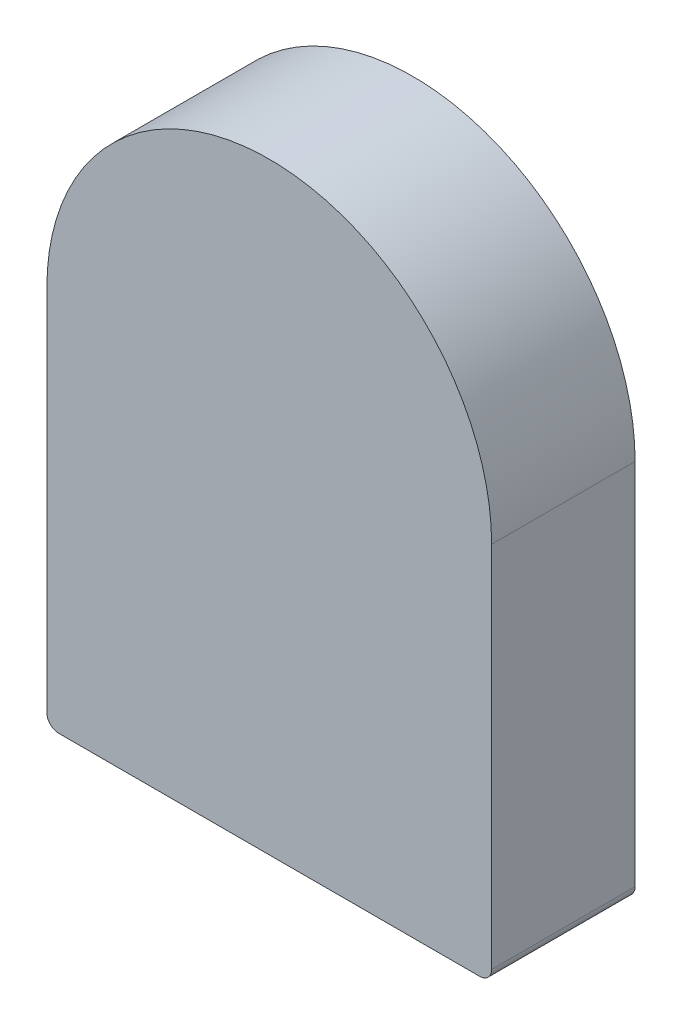
ISO-10303-21;
HEADER;
FILE_DESCRIPTION(('STEP AP214'),'2;1');
FILE_NAME('part.step','',(''),(''),'','','');
FILE_SCHEMA(('AUTOMOTIVE_DESIGN { 1 0 10303 214 1 1 1 1 }'));
ENDSEC;
DATA;
#1=APPLICATION_CONTEXT('core data for automotive mechanical design processes');
#2=APPLICATION_PROTOCOL_DEFINITION('international standard','automotive_design',2000,#1);
#3=PRODUCT_CONTEXT('',#1,'mechanical');
#4=PRODUCT('Part','Part','',(#3));
#5=PRODUCT_RELATED_PRODUCT_CATEGORY('part','',(#4));
#6=PRODUCT_DEFINITION_FORMATION('','',#4);
#7=PRODUCT_DEFINITION_CONTEXT('part definition',#1,'design');
#8=PRODUCT_DEFINITION('design','',#6,#7);
#9=PRODUCT_DEFINITION_SHAPE('','',#8);
#10=(LENGTH_UNIT() NAMED_UNIT(*) SI_UNIT(.MILLI.,.METRE.));
#11=(NAMED_UNIT(*) PLANE_ANGLE_UNIT() SI_UNIT($,.RADIAN.));
#12=(NAMED_UNIT(*) SI_UNIT($,.STERADIAN.) SOLID_ANGLE_UNIT());
#13=UNCERTAINTY_MEASURE_WITH_UNIT(LENGTH_MEASURE(1.E-05),#10,'distance_accuracy_value','');
#14=(GEOMETRIC_REPRESENTATION_CONTEXT(3) GLOBAL_UNCERTAINTY_ASSIGNED_CONTEXT((#13)) GLOBAL_UNIT_ASSIGNED_CONTEXT((#10,
#11,#12)) REPRESENTATION_CONTEXT('',''));
#15=CARTESIAN_POINT('',(0.,0.,0.));
#16=DIRECTION('',(0.,0.,1.));
#17=DIRECTION('',(1.,0.,0.));
#18=AXIS2_PLACEMENT_3D('',#15,#16,#17);
#19=CARTESIAN_POINT('',(0.,0.,6.));
#20=DIRECTION('',(0.,0.,-1.));
#21=DIRECTION('',(-1.,0.,0.));
#22=AXIS2_PLACEMENT_3D('',#19,#20,#21);
#23=CYLINDRICAL_SURFACE('',#22,9.3);
#24=CARTESIAN_POINT('',(0.,0.,0.));
#25=DIRECTION('',(0.,0.,1.));
#26=DIRECTION('',(1.,0.,0.));
#27=AXIS2_PLACEMENT_3D('',#24,#25,#26);
#28=CIRCLE('',#27,9.3);
#29=CARTESIAN_POINT('',(9.3,0.,0.));
#30=VERTEX_POINT('',#29);
#31=CARTESIAN_POINT('',(-9.3,0.,0.));
#32=VERTEX_POINT('',#31);
#33=EDGE_CURVE('E119',#30,#32,#28,.T.);
#34=ORIENTED_EDGE('',*,*,#33,.T.);
#35=DIRECTION('',(0.,0.,-1.));
#36=VECTOR('',#35,1.);
#37=CARTESIAN_POINT('',(-9.3,0.,6.));
#38=LINE('',#37,#36);
#39=CARTESIAN_POINT('',(-9.3,0.,6.));
#40=VERTEX_POINT('',#39);
#41=EDGE_CURVE('E100',#40,#32,#38,.T.);
#42=ORIENTED_EDGE('',*,*,#41,.F.);
#43=CARTESIAN_POINT('',(0.,0.,6.));
#44=DIRECTION('',(0.,0.,1.));
#45=DIRECTION('',(1.,0.,0.));
#46=AXIS2_PLACEMENT_3D('',#43,#44,#45);
#47=CIRCLE('',#46,9.3);
#48=CARTESIAN_POINT('',(9.3,0.,6.));
#49=VERTEX_POINT('',#48);
#50=EDGE_CURVE('E106',#49,#40,#47,.T.);
#51=ORIENTED_EDGE('',*,*,#50,.F.);
#52=DIRECTION('',(0.,0.,-1.));
#53=VECTOR('',#52,1.);
#54=CARTESIAN_POINT('',(9.3,0.,6.));
#55=LINE('',#54,#53);
#56=EDGE_CURVE('E122',#49,#30,#55,.T.);
#57=ORIENTED_EDGE('',*,*,#56,.T.);
#58=EDGE_LOOP('',(#34,#42,#51,#57));
#59=FACE_BOUND('',#58,.T.);
#60=ADVANCED_FACE('F43',(#59),#23,.T.);
#61=CARTESIAN_POINT('',(-9.3,0.,6.));
#62=DIRECTION('',(1.,0.,0.));
#63=DIRECTION('',(0.,1.,0.));
#64=AXIS2_PLACEMENT_3D('',#61,#62,#63);
#65=PLANE('',#64);
#66=DIRECTION('',(0.,-1.,0.));
#67=VECTOR('',#66,1.);
#68=CARTESIAN_POINT('',(-9.3,0.,0.));
#69=LINE('',#68,#67);
#70=CARTESIAN_POINT('',(-9.3,-15.4,0.));
#71=VERTEX_POINT('',#70);
#72=EDGE_CURVE('E162',#32,#71,#69,.T.);
#73=ORIENTED_EDGE('',*,*,#72,.T.);
#74=DIRECTION('',(0.,0.,-1.));
#75=VECTOR('',#74,1.);
#76=CARTESIAN_POINT('',(-9.3,-15.4,6.));
#77=LINE('',#76,#75);
#78=CARTESIAN_POINT('',(-9.3,-15.4,6.));
#79=VERTEX_POINT('',#78);
#80=EDGE_CURVE('E11',#71,#79,#77,.F.);
#81=ORIENTED_EDGE('',*,*,#80,.T.);
#82=DIRECTION('',(0.,-1.,0.));
#83=VECTOR('',#82,1.);
#84=CARTESIAN_POINT('',(-9.3,0.,6.));
#85=LINE('',#84,#83);
#86=EDGE_CURVE('E96',#40,#79,#85,.T.);
#87=ORIENTED_EDGE('',*,*,#86,.F.);
#88=ORIENTED_EDGE('',*,*,#41,.T.);
#89=EDGE_LOOP('',(#73,#81,#87,#88));
#90=FACE_BOUND('',#89,.T.);
#91=ADVANCED_FACE('F98',(#90),#65,.F.);
#92=CARTESIAN_POINT('',(-9.3,-15.9,6.));
#93=DIRECTION('',(0.,1.,0.));
#94=DIRECTION('',(0.,0.,1.));
#95=AXIS2_PLACEMENT_3D('',#92,#93,#94);
#96=PLANE('',#95);
#97=DIRECTION('',(1.,0.,0.));
#98=VECTOR('',#97,1.);
#99=CARTESIAN_POINT('',(-9.3,-15.9,0.));
#100=LINE('',#99,#98);
#101=CARTESIAN_POINT('',(-8.8,-15.9,0.));
#102=VERTEX_POINT('',#101);
#103=CARTESIAN_POINT('',(8.8,-15.9,0.));
#104=VERTEX_POINT('',#103);
#105=EDGE_CURVE('E158',#102,#104,#100,.T.);
#106=ORIENTED_EDGE('',*,*,#105,.T.);
#107=DIRECTION('',(0.,0.,-1.));
#108=VECTOR('',#107,1.);
#109=CARTESIAN_POINT('',(8.8,-15.9,6.));
#110=LINE('',#109,#108);
#111=CARTESIAN_POINT('',(8.8,-15.9,6.));
#112=VERTEX_POINT('',#111);
#113=EDGE_CURVE('E65',#104,#112,#110,.F.);
#114=ORIENTED_EDGE('',*,*,#113,.T.);
#115=DIRECTION('',(1.,0.,0.));
#116=VECTOR('',#115,1.);
#117=CARTESIAN_POINT('',(-9.3,-15.9,6.));
#118=LINE('',#117,#116);
#119=CARTESIAN_POINT('',(-8.8,-15.9,6.));
#120=VERTEX_POINT('',#119);
#121=EDGE_CURVE('E105',#120,#112,#118,.T.);
#122=ORIENTED_EDGE('',*,*,#121,.F.);
#123=DIRECTION('',(0.,0.,-1.));
#124=VECTOR('',#123,1.);
#125=CARTESIAN_POINT('',(-8.8,-15.9,6.));
#126=LINE('',#125,#124);
#127=EDGE_CURVE('E137',#120,#102,#126,.T.);
#128=ORIENTED_EDGE('',*,*,#127,.T.);
#129=EDGE_LOOP('',(#106,#114,#122,#128));
#130=FACE_BOUND('',#129,.T.);
#131=ADVANCED_FACE('F159',(#130),#96,.F.);
#132=CARTESIAN_POINT('',(9.3,0.,6.));
#133=DIRECTION('',(-1.,0.,0.));
#134=DIRECTION('',(0.,-1.,0.));
#135=AXIS2_PLACEMENT_3D('',#132,#133,#134);
#136=PLANE('',#135);
#137=DIRECTION('',(0.,1.,0.));
#138=VECTOR('',#137,1.);
#139=CARTESIAN_POINT('',(9.3,0.,6.));
#140=LINE('',#139,#138);
#141=CARTESIAN_POINT('',(9.3,-15.4,6.));
#142=VERTEX_POINT('',#141);
#143=EDGE_CURVE('E111',#142,#49,#140,.T.);
#144=ORIENTED_EDGE('',*,*,#143,.F.);
#145=DIRECTION('',(0.,0.,-1.));
#146=VECTOR('',#145,1.);
#147=CARTESIAN_POINT('',(9.3,-15.4,6.));
#148=LINE('',#147,#146);
#149=CARTESIAN_POINT('',(9.3,-15.4,0.));
#150=VERTEX_POINT('',#149);
#151=EDGE_CURVE('E121',#142,#150,#148,.T.);
#152=ORIENTED_EDGE('',*,*,#151,.T.);
#153=DIRECTION('',(0.,1.,0.));
#154=VECTOR('',#153,1.);
#155=CARTESIAN_POINT('',(9.3,0.,0.));
#156=LINE('',#155,#154);
#157=EDGE_CURVE('E116',#150,#30,#156,.T.);
#158=ORIENTED_EDGE('',*,*,#157,.T.);
#159=ORIENTED_EDGE('',*,*,#56,.F.);
#160=EDGE_LOOP('',(#144,#152,#158,#159));
#161=FACE_BOUND('',#160,.T.);
#162=ADVANCED_FACE('F150',(#161),#136,.F.);
#163=CARTESIAN_POINT('',(0.,0.,6.));
#164=DIRECTION('',(0.,0.,1.));
#165=DIRECTION('',(1.,0.,0.));
#166=AXIS2_PLACEMENT_3D('',#163,#164,#165);
#167=PLANE('',#166);
#168=ORIENTED_EDGE('',*,*,#121,.T.);
#169=CARTESIAN_POINT('',(8.8,-15.4,6.));
#170=DIRECTION('',(0.,0.,1.));
#171=DIRECTION('',(1.,0.,0.));
#172=AXIS2_PLACEMENT_3D('',#169,#170,#171);
#173=CIRCLE('',#172,0.5);
#174=EDGE_CURVE('E52',#112,#142,#173,.T.);
#175=ORIENTED_EDGE('',*,*,#174,.T.);
#176=ORIENTED_EDGE('',*,*,#143,.T.);
#177=ORIENTED_EDGE('',*,*,#50,.T.);
#178=ORIENTED_EDGE('',*,*,#86,.T.);
#179=CARTESIAN_POINT('',(-8.8,-15.4,6.));
#180=DIRECTION('',(0.,0.,1.));
#181=DIRECTION('',(1.,0.,0.));
#182=AXIS2_PLACEMENT_3D('',#179,#180,#181);
#183=CIRCLE('',#182,0.5);
#184=EDGE_CURVE('E143',#79,#120,#183,.T.);
#185=ORIENTED_EDGE('',*,*,#184,.T.);
#186=EDGE_LOOP('',(#168,#175,#176,#177,#178,#185));
#187=FACE_BOUND('',#186,.T.);
#188=ADVANCED_FACE('F109',(#187),#167,.T.);
#189=CARTESIAN_POINT('',(0.,0.,0.));
#190=DIRECTION('',(0.,0.,1.));
#191=DIRECTION('',(1.,0.,0.));
#192=AXIS2_PLACEMENT_3D('',#189,#190,#191);
#193=PLANE('',#192);
#194=ORIENTED_EDGE('',*,*,#157,.F.);
#195=CARTESIAN_POINT('',(8.8,-15.4,0.));
#196=DIRECTION('',(0.,0.,1.));
#197=DIRECTION('',(1.,0.,0.));
#198=AXIS2_PLACEMENT_3D('',#195,#196,#197);
#199=CIRCLE('',#198,0.5);
#200=EDGE_CURVE('E134',#150,#104,#199,.F.);
#201=ORIENTED_EDGE('',*,*,#200,.T.);
#202=ORIENTED_EDGE('',*,*,#105,.F.);
#203=CARTESIAN_POINT('',(-8.8,-15.4,0.));
#204=DIRECTION('',(0.,0.,1.));
#205=DIRECTION('',(1.,0.,0.));
#206=AXIS2_PLACEMENT_3D('',#203,#204,#205);
#207=CIRCLE('',#206,0.5);
#208=EDGE_CURVE('E127',#102,#71,#207,.F.);
#209=ORIENTED_EDGE('',*,*,#208,.T.);
#210=ORIENTED_EDGE('',*,*,#72,.F.);
#211=ORIENTED_EDGE('',*,*,#33,.F.);
#212=EDGE_LOOP('',(#194,#201,#202,#209,#210,#211));
#213=FACE_BOUND('',#212,.T.);
#214=ADVANCED_FACE('F157',(#213),#193,.F.);
#215=CARTESIAN_POINT('',(8.8,-15.4,6.));
#216=DIRECTION('',(0.,0.,-1.));
#217=DIRECTION('',(-1.,0.,0.));
#218=AXIS2_PLACEMENT_3D('',#215,#216,#217);
#219=CYLINDRICAL_SURFACE('',#218,0.5);
#220=ORIENTED_EDGE('',*,*,#174,.F.);
#221=ORIENTED_EDGE('',*,*,#113,.F.);
#222=ORIENTED_EDGE('',*,*,#200,.F.);
#223=ORIENTED_EDGE('',*,*,#151,.F.);
#224=EDGE_LOOP('',(#220,#221,#222,#223));
#225=FACE_BOUND('',#224,.T.);
#226=ADVANCED_FACE('F154',(#225),#219,.T.);
#227=CARTESIAN_POINT('',(-8.8,-15.4,6.));
#228=DIRECTION('',(0.,0.,-1.));
#229=DIRECTION('',(-1.,0.,0.));
#230=AXIS2_PLACEMENT_3D('',#227,#228,#229);
#231=CYLINDRICAL_SURFACE('',#230,0.5);
#232=ORIENTED_EDGE('',*,*,#184,.F.);
#233=ORIENTED_EDGE('',*,*,#80,.F.);
#234=ORIENTED_EDGE('',*,*,#208,.F.);
#235=ORIENTED_EDGE('',*,*,#127,.F.);
#236=EDGE_LOOP('',(#232,#233,#234,#235));
#237=FACE_BOUND('',#236,.T.);
#238=ADVANCED_FACE('F45',(#237),#231,.T.);
#239=CLOSED_SHELL('',(#60,#91,#131,#162,#188,#214,#226,#238));
#240=MANIFOLD_SOLID_BREP('B2',#239);
#241=ADVANCED_BREP_SHAPE_REPRESENTATION('',(#18,#240),#14);
#242=SHAPE_DEFINITION_REPRESENTATION(#9,#241);
ENDSEC;
END-ISO-10303-21;
